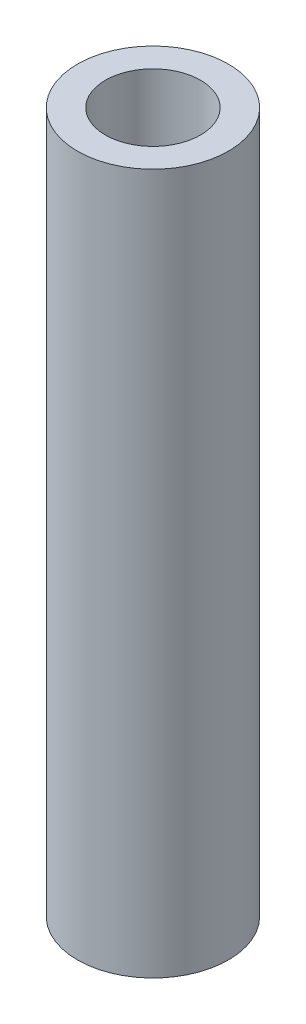
ISO-10303-21;
HEADER;
FILE_DESCRIPTION(('STEP AP214'),'2;1');
FILE_NAME('part.step','',(''),(''),'','','');
FILE_SCHEMA(('AUTOMOTIVE_DESIGN { 1 0 10303 214 1 1 1 1 }'));
ENDSEC;
DATA;
#1=APPLICATION_CONTEXT('core data for automotive mechanical design processes');
#2=APPLICATION_PROTOCOL_DEFINITION('international standard','automotive_design',2000,#1);
#3=PRODUCT_CONTEXT('',#1,'mechanical');
#4=PRODUCT('Part','Part','',(#3));
#5=PRODUCT_RELATED_PRODUCT_CATEGORY('part','',(#4));
#6=PRODUCT_DEFINITION_FORMATION('','',#4);
#7=PRODUCT_DEFINITION_CONTEXT('part definition',#1,'design');
#8=PRODUCT_DEFINITION('design','',#6,#7);
#9=PRODUCT_DEFINITION_SHAPE('','',#8);
#10=(LENGTH_UNIT() NAMED_UNIT(*) SI_UNIT(.MILLI.,.METRE.));
#11=(NAMED_UNIT(*) PLANE_ANGLE_UNIT() SI_UNIT($,.RADIAN.));
#12=(NAMED_UNIT(*) SI_UNIT($,.STERADIAN.) SOLID_ANGLE_UNIT());
#13=UNCERTAINTY_MEASURE_WITH_UNIT(LENGTH_MEASURE(1.E-05),#10,'distance_accuracy_value','');
#14=(GEOMETRIC_REPRESENTATION_CONTEXT(3) GLOBAL_UNCERTAINTY_ASSIGNED_CONTEXT((#13)) GLOBAL_UNIT_ASSIGNED_CONTEXT((#10,
#11,#12)) REPRESENTATION_CONTEXT('',''));
#15=CARTESIAN_POINT('',(0.,0.,0.));
#16=DIRECTION('',(0.,0.,1.));
#17=DIRECTION('',(1.,0.,0.));
#18=AXIS2_PLACEMENT_3D('',#15,#16,#17);
#19=CARTESIAN_POINT('',(0.,-29.464,0.));
#20=DIRECTION('',(0.,1.,0.));
#21=DIRECTION('',(0.,0.,1.));
#22=AXIS2_PLACEMENT_3D('',#19,#20,#21);
#23=CYLINDRICAL_SURFACE('',#22,3.175);
#24=CARTESIAN_POINT('',(0.,-29.464,0.));
#25=DIRECTION('',(0.,1.,0.));
#26=DIRECTION('',(0.,0.,1.));
#27=AXIS2_PLACEMENT_3D('',#24,#25,#26);
#28=CIRCLE('',#27,3.175);
#29=CARTESIAN_POINT('',(0.,-29.464,3.175));
#30=VERTEX_POINT('',#29);
#31=EDGE_CURVE('E10',#30,#30,#28,.T.);
#32=ORIENTED_EDGE('',*,*,#31,.T.);
#33=EDGE_LOOP('',(#32));
#34=FACE_BOUND('',#33,.T.);
#35=CARTESIAN_POINT('',(0.,0.,0.));
#36=DIRECTION('',(0.,1.,0.));
#37=DIRECTION('',(0.,0.,1.));
#38=AXIS2_PLACEMENT_3D('',#35,#36,#37);
#39=CIRCLE('',#38,3.175);
#40=CARTESIAN_POINT('',(0.,0.,3.175));
#41=VERTEX_POINT('',#40);
#42=EDGE_CURVE('E36',#41,#41,#39,.T.);
#43=ORIENTED_EDGE('',*,*,#42,.F.);
#44=EDGE_LOOP('',(#43));
#45=FACE_BOUND('',#44,.T.);
#46=ADVANCED_FACE('F33',(#34,#45),#23,.T.);
#47=CARTESIAN_POINT('',(0.,-29.464,0.));
#48=DIRECTION('',(0.,1.,0.));
#49=DIRECTION('',(0.,0.,1.));
#50=AXIS2_PLACEMENT_3D('',#47,#48,#49);
#51=PLANE('',#50);
#52=CARTESIAN_POINT('',(0.,-29.464,0.));
#53=DIRECTION('',(0.,1.,0.));
#54=DIRECTION('',(0.,0.,1.));
#55=AXIS2_PLACEMENT_3D('',#52,#53,#54);
#56=CIRCLE('',#55,2.);
#57=CARTESIAN_POINT('',(0.,-29.464,2.));
#58=VERTEX_POINT('',#57);
#59=EDGE_CURVE('E43',#58,#58,#56,.T.);
#60=ORIENTED_EDGE('',*,*,#59,.T.);
#61=EDGE_LOOP('',(#60));
#62=FACE_BOUND('',#61,.T.);
#63=ORIENTED_EDGE('',*,*,#31,.F.);
#64=EDGE_LOOP('',(#63));
#65=FACE_BOUND('',#64,.T.);
#66=ADVANCED_FACE('F51',(#62,#65),#51,.F.);
#67=CARTESIAN_POINT('',(0.,0.,0.));
#68=DIRECTION('',(0.,1.,0.));
#69=DIRECTION('',(0.,0.,1.));
#70=AXIS2_PLACEMENT_3D('',#67,#68,#69);
#71=PLANE('',#70);
#72=CARTESIAN_POINT('',(0.,0.,0.));
#73=DIRECTION('',(0.,1.,0.));
#74=DIRECTION('',(0.,0.,1.));
#75=AXIS2_PLACEMENT_3D('',#72,#73,#74);
#76=CIRCLE('',#75,2.);
#77=CARTESIAN_POINT('',(0.,0.,2.));
#78=VERTEX_POINT('',#77);
#79=EDGE_CURVE('E45',#78,#78,#76,.T.);
#80=ORIENTED_EDGE('',*,*,#79,.F.);
#81=EDGE_LOOP('',(#80));
#82=FACE_BOUND('',#81,.T.);
#83=ORIENTED_EDGE('',*,*,#42,.T.);
#84=EDGE_LOOP('',(#83));
#85=FACE_BOUND('',#84,.T.);
#86=ADVANCED_FACE('F57',(#82,#85),#71,.T.);
#87=CARTESIAN_POINT('',(0.,-29.464,0.));
#88=DIRECTION('',(0.,1.,0.));
#89=DIRECTION('',(0.,0.,1.));
#90=AXIS2_PLACEMENT_3D('',#87,#88,#89);
#91=CYLINDRICAL_SURFACE('',#90,2.);
#92=ORIENTED_EDGE('',*,*,#59,.F.);
#93=EDGE_LOOP('',(#92));
#94=FACE_BOUND('',#93,.T.);
#95=ORIENTED_EDGE('',*,*,#79,.T.);
#96=EDGE_LOOP('',(#95));
#97=FACE_BOUND('',#96,.T.);
#98=ADVANCED_FACE('F54',(#94,#97),#91,.F.);
#99=CLOSED_SHELL('',(#46,#66,#86,#98));
#100=MANIFOLD_SOLID_BREP('B2',#99);
#101=ADVANCED_BREP_SHAPE_REPRESENTATION('',(#18,#100),#14);
#102=SHAPE_DEFINITION_REPRESENTATION(#9,#101);
ENDSEC;
END-ISO-10303-21;
